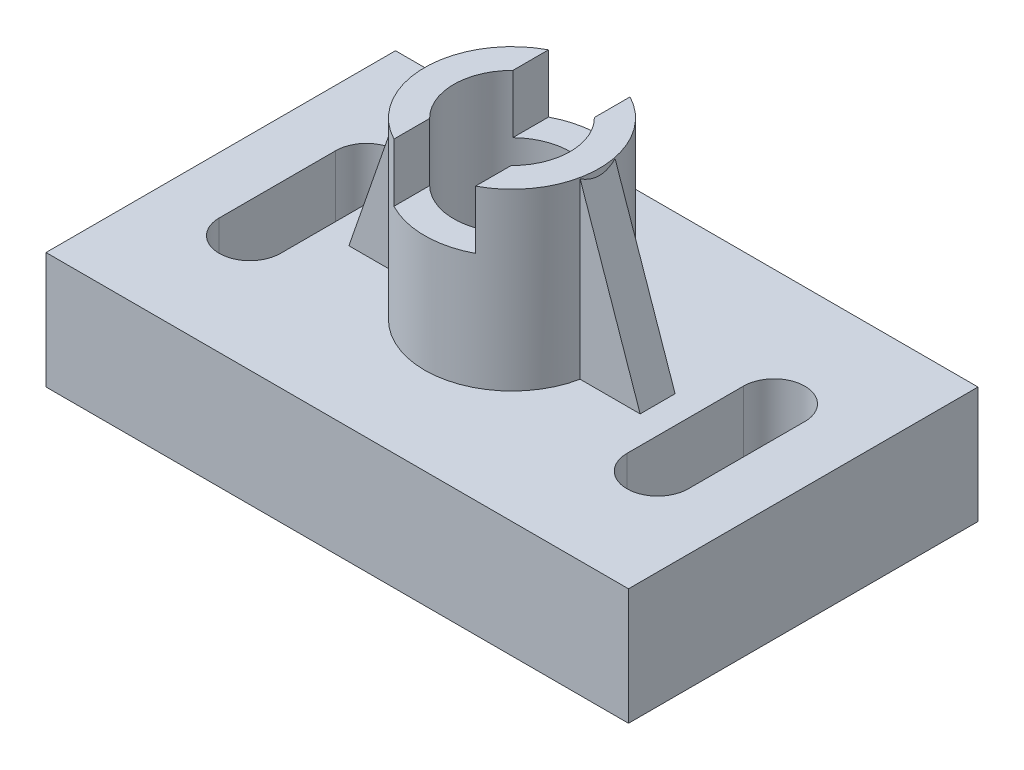
ISO-10303-21;
HEADER;
FILE_DESCRIPTION(('STEP AP214'),'2;1');
FILE_NAME('part.step','',(''),(''),'','','');
FILE_SCHEMA(('AUTOMOTIVE_DESIGN { 1 0 10303 214 1 1 1 1 }'));
ENDSEC;
DATA;
#1=APPLICATION_CONTEXT('core data for automotive mechanical design processes');
#2=APPLICATION_PROTOCOL_DEFINITION('international standard','automotive_design',2000,#1);
#3=PRODUCT_CONTEXT('',#1,'mechanical');
#4=PRODUCT('Part','Part','',(#3));
#5=PRODUCT_RELATED_PRODUCT_CATEGORY('part','',(#4));
#6=PRODUCT_DEFINITION_FORMATION('','',#4);
#7=PRODUCT_DEFINITION_CONTEXT('part definition',#1,'design');
#8=PRODUCT_DEFINITION('design','',#6,#7);
#9=PRODUCT_DEFINITION_SHAPE('','',#8);
#10=(LENGTH_UNIT() NAMED_UNIT(*) SI_UNIT(.MILLI.,.METRE.));
#11=(NAMED_UNIT(*) PLANE_ANGLE_UNIT() SI_UNIT($,.RADIAN.));
#12=(NAMED_UNIT(*) SI_UNIT($,.STERADIAN.) SOLID_ANGLE_UNIT());
#13=UNCERTAINTY_MEASURE_WITH_UNIT(LENGTH_MEASURE(1.E-05),#10,'distance_accuracy_value','');
#14=(GEOMETRIC_REPRESENTATION_CONTEXT(3) GLOBAL_UNCERTAINTY_ASSIGNED_CONTEXT((#13)) GLOBAL_UNIT_ASSIGNED_CONTEXT((#10,
#11,#12)) REPRESENTATION_CONTEXT('',''));
#15=CARTESIAN_POINT('',(0.,0.,0.));
#16=DIRECTION('',(0.,0.,1.));
#17=DIRECTION('',(1.,0.,0.));
#18=AXIS2_PLACEMENT_3D('',#15,#16,#17);
#19=CARTESIAN_POINT('',(0.,50.,0.));
#20=DIRECTION('',(0.,1.,0.));
#21=DIRECTION('',(0.,0.,1.));
#22=AXIS2_PLACEMENT_3D('',#19,#20,#21);
#23=PLANE('',#22);
#24=DIRECTION('',(0.,0.,-1.));
#25=VECTOR('',#24,1.);
#26=CARTESIAN_POINT('',(-7.,50.,0.));
#27=LINE('',#26,#25);
#28=CARTESIAN_POINT('',(-7.,50.,13.2664991614216));
#29=VERTEX_POINT('',#28);
#30=CARTESIAN_POINT('',(-7.,50.,7.14142842854285));
#31=VERTEX_POINT('',#30);
#32=EDGE_CURVE('E460',#29,#31,#27,.T.);
#33=ORIENTED_EDGE('',*,*,#32,.T.);
#34=CARTESIAN_POINT('',(0.,50.,0.));
#35=DIRECTION('',(0.,1.,0.));
#36=DIRECTION('',(0.,0.,1.));
#37=AXIS2_PLACEMENT_3D('',#34,#35,#36);
#38=CIRCLE('',#37,10.);
#39=CARTESIAN_POINT('',(-7.,50.,-7.14142842854285));
#40=VERTEX_POINT('',#39);
#41=EDGE_CURVE('E222',#40,#31,#38,.T.);
#42=ORIENTED_EDGE('',*,*,#41,.F.);
#43=CARTESIAN_POINT('',(-7.,50.,-13.2664991614216));
#44=VERTEX_POINT('',#43);
#45=EDGE_CURVE('E456',#40,#44,#27,.T.);
#46=ORIENTED_EDGE('',*,*,#45,.T.);
#47=CARTESIAN_POINT('',(0.,50.,0.));
#48=DIRECTION('',(0.,1.,0.));
#49=DIRECTION('',(0.,0.,1.));
#50=AXIS2_PLACEMENT_3D('',#47,#48,#49);
#51=CIRCLE('',#50,15.);
#52=EDGE_CURVE('E323',#44,#29,#51,.T.);
#53=ORIENTED_EDGE('',*,*,#52,.T.);
#54=EDGE_LOOP('',(#33,#42,#46,#53));
#55=FACE_BOUND('',#54,.T.);
#56=ADVANCED_FACE('F41',(#55),#23,.T.);
#57=CARTESIAN_POINT('',(-35.,20.,9.99999999999999));
#58=DIRECTION('',(0.,-1.,0.));
#59=DIRECTION('',(0.,0.,-1.));
#60=AXIS2_PLACEMENT_3D('',#57,#58,#59);
#61=CYLINDRICAL_SURFACE('',#60,5.26829268292683);
#62=CARTESIAN_POINT('',(-35.,0.,9.99999999999999));
#63=DIRECTION('',(0.,1.,0.));
#64=DIRECTION('',(0.,0.,1.));
#65=AXIS2_PLACEMENT_3D('',#62,#63,#64);
#66=CIRCLE('',#65,5.26829268292683);
#67=CARTESIAN_POINT('',(-40.2682926829268,0.,10.));
#68=VERTEX_POINT('',#67);
#69=CARTESIAN_POINT('',(-29.7317073170732,0.,9.99999999999999));
#70=VERTEX_POINT('',#69);
#71=EDGE_CURVE('E397',#68,#70,#66,.T.);
#72=ORIENTED_EDGE('',*,*,#71,.F.);
#73=DIRECTION('',(0.,-1.,0.));
#74=VECTOR('',#73,1.);
#75=CARTESIAN_POINT('',(-40.2682926829268,20.,10.));
#76=LINE('',#75,#74);
#77=CARTESIAN_POINT('',(-40.2682926829268,20.,10.));
#78=VERTEX_POINT('',#77);
#79=EDGE_CURVE('E421',#78,#68,#76,.T.);
#80=ORIENTED_EDGE('',*,*,#79,.F.);
#81=CARTESIAN_POINT('',(-35.,20.,9.99999999999999));
#82=DIRECTION('',(0.,1.,0.));
#83=DIRECTION('',(0.,0.,1.));
#84=AXIS2_PLACEMENT_3D('',#81,#82,#83);
#85=CIRCLE('',#84,5.26829268292683);
#86=CARTESIAN_POINT('',(-29.7317073170732,20.,9.99999999999999));
#87=VERTEX_POINT('',#86);
#88=EDGE_CURVE('E356',#78,#87,#85,.T.);
#89=ORIENTED_EDGE('',*,*,#88,.T.);
#90=DIRECTION('',(0.,-1.,0.));
#91=VECTOR('',#90,1.);
#92=CARTESIAN_POINT('',(-29.7317073170732,20.,9.99999999999999));
#93=LINE('',#92,#91);
#94=EDGE_CURVE('E410',#87,#70,#93,.T.);
#95=ORIENTED_EDGE('',*,*,#94,.T.);
#96=EDGE_LOOP('',(#72,#80,#89,#95));
#97=FACE_BOUND('',#96,.T.);
#98=ADVANCED_FACE('F536',(#97),#61,.F.);
#99=CARTESIAN_POINT('',(-40.2682926829268,20.,0.));
#100=DIRECTION('',(1.,0.,0.));
#101=DIRECTION('',(0.,0.,-1.));
#102=AXIS2_PLACEMENT_3D('',#99,#100,#101);
#103=PLANE('',#102);
#104=ORIENTED_EDGE('',*,*,#79,.T.);
#105=DIRECTION('',(0.,0.,1.));
#106=VECTOR('',#105,1.);
#107=CARTESIAN_POINT('',(-40.2682926829268,0.,0.));
#108=LINE('',#107,#106);
#109=CARTESIAN_POINT('',(-40.2682926829268,0.,-10.));
#110=VERTEX_POINT('',#109);
#111=EDGE_CURVE('E401',#110,#68,#108,.T.);
#112=ORIENTED_EDGE('',*,*,#111,.F.);
#113=DIRECTION('',(0.,-1.,0.));
#114=VECTOR('',#113,1.);
#115=CARTESIAN_POINT('',(-40.2682926829268,20.,-10.));
#116=LINE('',#115,#114);
#117=CARTESIAN_POINT('',(-40.2682926829268,20.,-10.));
#118=VERTEX_POINT('',#117);
#119=EDGE_CURVE('E418',#118,#110,#116,.T.);
#120=ORIENTED_EDGE('',*,*,#119,.F.);
#121=DIRECTION('',(0.,0.,1.));
#122=VECTOR('',#121,1.);
#123=CARTESIAN_POINT('',(-40.2682926829268,20.,0.));
#124=LINE('',#123,#122);
#125=EDGE_CURVE('E360',#118,#78,#124,.T.);
#126=ORIENTED_EDGE('',*,*,#125,.T.);
#127=EDGE_LOOP('',(#104,#112,#120,#126));
#128=FACE_BOUND('',#127,.T.);
#129=ADVANCED_FACE('F541',(#128),#103,.T.);
#130=CARTESIAN_POINT('',(-35.,20.,-10.));
#131=DIRECTION('',(0.,-1.,0.));
#132=DIRECTION('',(0.,0.,-1.));
#133=AXIS2_PLACEMENT_3D('',#130,#131,#132);
#134=CYLINDRICAL_SURFACE('',#133,5.26829268292683);
#135=CARTESIAN_POINT('',(-35.,0.,-10.));
#136=DIRECTION('',(0.,1.,0.));
#137=DIRECTION('',(0.,0.,1.));
#138=AXIS2_PLACEMENT_3D('',#135,#136,#137);
#139=CIRCLE('',#138,5.26829268292683);
#140=CARTESIAN_POINT('',(-29.7317073170732,0.,-10.));
#141=VERTEX_POINT('',#140);
#142=EDGE_CURVE('E404',#141,#110,#139,.T.);
#143=ORIENTED_EDGE('',*,*,#142,.F.);
#144=DIRECTION('',(0.,-1.,0.));
#145=VECTOR('',#144,1.);
#146=CARTESIAN_POINT('',(-29.7317073170732,20.,-10.));
#147=LINE('',#146,#145);
#148=CARTESIAN_POINT('',(-29.7317073170732,20.,-10.));
#149=VERTEX_POINT('',#148);
#150=EDGE_CURVE('E414',#149,#141,#147,.T.);
#151=ORIENTED_EDGE('',*,*,#150,.F.);
#152=CARTESIAN_POINT('',(-35.,20.,-10.));
#153=DIRECTION('',(0.,1.,0.));
#154=DIRECTION('',(0.,0.,1.));
#155=AXIS2_PLACEMENT_3D('',#152,#153,#154);
#156=CIRCLE('',#155,5.26829268292683);
#157=EDGE_CURVE('E363',#149,#118,#156,.T.);
#158=ORIENTED_EDGE('',*,*,#157,.T.);
#159=ORIENTED_EDGE('',*,*,#119,.T.);
#160=EDGE_LOOP('',(#143,#151,#158,#159));
#161=FACE_BOUND('',#160,.T.);
#162=ADVANCED_FACE('F571',(#161),#134,.F.);
#163=CARTESIAN_POINT('',(40.2682926829268,20.,0.));
#164=DIRECTION('',(1.,0.,0.));
#165=DIRECTION('',(0.,0.,-1.));
#166=AXIS2_PLACEMENT_3D('',#163,#164,#165);
#167=PLANE('',#166);
#168=DIRECTION('',(0.,-1.,0.));
#169=VECTOR('',#168,1.);
#170=CARTESIAN_POINT('',(40.2682926829268,20.,9.99999999999998));
#171=LINE('',#170,#169);
#172=CARTESIAN_POINT('',(40.2682926829268,20.,9.99999999999998));
#173=VERTEX_POINT('',#172);
#174=CARTESIAN_POINT('',(40.2682926829268,0.,9.99999999999998));
#175=VERTEX_POINT('',#174);
#176=EDGE_CURVE('E415',#173,#175,#171,.T.);
#177=ORIENTED_EDGE('',*,*,#176,.F.);
#178=DIRECTION('',(0.,0.,1.));
#179=VECTOR('',#178,1.);
#180=CARTESIAN_POINT('',(40.2682926829268,20.,0.));
#181=LINE('',#180,#179);
#182=CARTESIAN_POINT('',(40.2682926829268,20.,-10.));
#183=VERTEX_POINT('',#182);
#184=EDGE_CURVE('E343',#183,#173,#181,.T.);
#185=ORIENTED_EDGE('',*,*,#184,.F.);
#186=DIRECTION('',(0.,-1.,0.));
#187=VECTOR('',#186,1.);
#188=CARTESIAN_POINT('',(40.2682926829268,20.,-10.));
#189=LINE('',#188,#187);
#190=CARTESIAN_POINT('',(40.2682926829268,0.,-10.));
#191=VERTEX_POINT('',#190);
#192=EDGE_CURVE('E426',#183,#191,#189,.T.);
#193=ORIENTED_EDGE('',*,*,#192,.T.);
#194=DIRECTION('',(0.,0.,1.));
#195=VECTOR('',#194,1.);
#196=CARTESIAN_POINT('',(40.2682926829268,0.,0.));
#197=LINE('',#196,#195);
#198=EDGE_CURVE('E384',#191,#175,#197,.T.);
#199=ORIENTED_EDGE('',*,*,#198,.T.);
#200=EDGE_LOOP('',(#177,#185,#193,#199));
#201=FACE_BOUND('',#200,.T.);
#202=ADVANCED_FACE('F574',(#201),#167,.F.);
#203=CARTESIAN_POINT('',(35.,20.,9.99999999999998));
#204=DIRECTION('',(0.,-1.,0.));
#205=DIRECTION('',(0.,0.,-1.));
#206=AXIS2_PLACEMENT_3D('',#203,#204,#205);
#207=CYLINDRICAL_SURFACE('',#206,5.26829268292683);
#208=CARTESIAN_POINT('',(35.,0.,9.99999999999998));
#209=DIRECTION('',(0.,1.,0.));
#210=DIRECTION('',(0.,0.,1.));
#211=AXIS2_PLACEMENT_3D('',#208,#209,#210);
#212=CIRCLE('',#211,5.26829268292683);
#213=CARTESIAN_POINT('',(29.7317073170732,0.,9.99999999999998));
#214=VERTEX_POINT('',#213);
#215=EDGE_CURVE('E387',#175,#214,#212,.F.);
#216=ORIENTED_EDGE('',*,*,#215,.T.);
#217=DIRECTION('',(0.,-1.,0.));
#218=VECTOR('',#217,1.);
#219=CARTESIAN_POINT('',(29.7317073170732,20.,9.99999999999998));
#220=LINE('',#219,#218);
#221=CARTESIAN_POINT('',(29.7317073170732,20.,9.99999999999998));
#222=VERTEX_POINT('',#221);
#223=EDGE_CURVE('E434',#222,#214,#220,.T.);
#224=ORIENTED_EDGE('',*,*,#223,.F.);
#225=CARTESIAN_POINT('',(35.,20.,9.99999999999998));
#226=DIRECTION('',(0.,1.,0.));
#227=DIRECTION('',(0.,0.,1.));
#228=AXIS2_PLACEMENT_3D('',#225,#226,#227);
#229=CIRCLE('',#228,5.26829268292683);
#230=EDGE_CURVE('E346',#173,#222,#229,.F.);
#231=ORIENTED_EDGE('',*,*,#230,.F.);
#232=ORIENTED_EDGE('',*,*,#176,.T.);
#233=EDGE_LOOP('',(#216,#224,#231,#232));
#234=FACE_BOUND('',#233,.T.);
#235=ADVANCED_FACE('F587',(#234),#207,.F.);
#236=CARTESIAN_POINT('',(29.7317073170732,20.,0.));
#237=DIRECTION('',(1.,0.,0.));
#238=DIRECTION('',(0.,0.,-1.));
#239=AXIS2_PLACEMENT_3D('',#236,#237,#238);
#240=PLANE('',#239);
#241=ORIENTED_EDGE('',*,*,#223,.T.);
#242=DIRECTION('',(0.,0.,1.));
#243=VECTOR('',#242,1.);
#244=CARTESIAN_POINT('',(29.7317073170732,0.,0.));
#245=LINE('',#244,#243);
#246=CARTESIAN_POINT('',(29.7317073170732,0.,-10.));
#247=VERTEX_POINT('',#246);
#248=EDGE_CURVE('E391',#247,#214,#245,.T.);
#249=ORIENTED_EDGE('',*,*,#248,.F.);
#250=DIRECTION('',(0.,-1.,0.));
#251=VECTOR('',#250,1.);
#252=CARTESIAN_POINT('',(29.7317073170732,20.,-10.));
#253=LINE('',#252,#251);
#254=CARTESIAN_POINT('',(29.7317073170732,20.,-10.));
#255=VERTEX_POINT('',#254);
#256=EDGE_CURVE('E430',#255,#247,#253,.T.);
#257=ORIENTED_EDGE('',*,*,#256,.F.);
#258=DIRECTION('',(0.,0.,1.));
#259=VECTOR('',#258,1.);
#260=CARTESIAN_POINT('',(29.7317073170732,20.,0.));
#261=LINE('',#260,#259);
#262=EDGE_CURVE('E350',#255,#222,#261,.T.);
#263=ORIENTED_EDGE('',*,*,#262,.T.);
#264=EDGE_LOOP('',(#241,#249,#257,#263));
#265=FACE_BOUND('',#264,.T.);
#266=ADVANCED_FACE('F584',(#265),#240,.T.);
#267=CARTESIAN_POINT('',(50.,20.,0.));
#268=DIRECTION('',(1.,0.,0.));
#269=DIRECTION('',(0.,0.,-1.));
#270=AXIS2_PLACEMENT_3D('',#267,#268,#269);
#271=PLANE('',#270);
#272=DIRECTION('',(0.,-1.,0.));
#273=VECTOR('',#272,1.);
#274=CARTESIAN_POINT('',(50.,20.,30.));
#275=LINE('',#274,#273);
#276=CARTESIAN_POINT('',(50.,20.,30.));
#277=VERTEX_POINT('',#276);
#278=CARTESIAN_POINT('',(50.,0.,30.));
#279=VERTEX_POINT('',#278);
#280=EDGE_CURVE('E370',#277,#279,#275,.T.);
#281=ORIENTED_EDGE('',*,*,#280,.T.);
#282=DIRECTION('',(0.,0.,1.));
#283=VECTOR('',#282,1.);
#284=CARTESIAN_POINT('',(50.,0.,0.));
#285=LINE('',#284,#283);
#286=CARTESIAN_POINT('',(50.,0.,-30.));
#287=VERTEX_POINT('',#286);
#288=EDGE_CURVE('E326',#287,#279,#285,.T.);
#289=ORIENTED_EDGE('',*,*,#288,.F.);
#290=DIRECTION('',(0.,-1.,0.));
#291=VECTOR('',#290,1.);
#292=CARTESIAN_POINT('',(50.,20.,-30.));
#293=LINE('',#292,#291);
#294=CARTESIAN_POINT('',(50.,20.,-30.));
#295=VERTEX_POINT('',#294);
#296=EDGE_CURVE('E431',#295,#287,#293,.T.);
#297=ORIENTED_EDGE('',*,*,#296,.F.);
#298=DIRECTION('',(0.,0.,1.));
#299=VECTOR('',#298,1.);
#300=CARTESIAN_POINT('',(50.,20.,0.));
#301=LINE('',#300,#299);
#302=EDGE_CURVE('E328',#295,#277,#301,.T.);
#303=ORIENTED_EDGE('',*,*,#302,.T.);
#304=EDGE_LOOP('',(#281,#289,#297,#303));
#305=FACE_BOUND('',#304,.T.);
#306=ADVANCED_FACE('F43',(#305),#271,.T.);
#307=CARTESIAN_POINT('',(0.,20.,-30.));
#308=DIRECTION('',(0.,0.,-1.));
#309=DIRECTION('',(-1.,0.,0.));
#310=AXIS2_PLACEMENT_3D('',#307,#308,#309);
#311=PLANE('',#310);
#312=DIRECTION('',(1.,0.,0.));
#313=VECTOR('',#312,1.);
#314=CARTESIAN_POINT('',(0.,0.,-30.));
#315=LINE('',#314,#313);
#316=CARTESIAN_POINT('',(-50.,0.,-30.));
#317=VERTEX_POINT('',#316);
#318=EDGE_CURVE('E373',#317,#287,#315,.T.);
#319=ORIENTED_EDGE('',*,*,#318,.F.);
#320=DIRECTION('',(0.,-1.,0.));
#321=VECTOR('',#320,1.);
#322=CARTESIAN_POINT('',(-50.,20.,-30.));
#323=LINE('',#322,#321);
#324=CARTESIAN_POINT('',(-50.,20.,-30.));
#325=VERTEX_POINT('',#324);
#326=EDGE_CURVE('E448',#325,#317,#323,.T.);
#327=ORIENTED_EDGE('',*,*,#326,.F.);
#328=DIRECTION('',(1.,0.,0.));
#329=VECTOR('',#328,1.);
#330=CARTESIAN_POINT('',(0.,20.,-30.));
#331=LINE('',#330,#329);
#332=EDGE_CURVE('E331',#325,#295,#331,.T.);
#333=ORIENTED_EDGE('',*,*,#332,.T.);
#334=ORIENTED_EDGE('',*,*,#296,.T.);
#335=EDGE_LOOP('',(#319,#327,#333,#334));
#336=FACE_BOUND('',#335,.T.);
#337=ADVANCED_FACE('F599',(#336),#311,.T.);
#338=CARTESIAN_POINT('',(-50.,20.,0.));
#339=DIRECTION('',(1.,0.,0.));
#340=DIRECTION('',(0.,0.,-1.));
#341=AXIS2_PLACEMENT_3D('',#338,#339,#340);
#342=PLANE('',#341);
#343=DIRECTION('',(0.,-1.,0.));
#344=VECTOR('',#343,1.);
#345=CARTESIAN_POINT('',(-50.,20.,30.));
#346=LINE('',#345,#344);
#347=CARTESIAN_POINT('',(-50.,20.,30.));
#348=VERTEX_POINT('',#347);
#349=CARTESIAN_POINT('',(-50.,0.,30.));
#350=VERTEX_POINT('',#349);
#351=EDGE_CURVE('E444',#348,#350,#346,.T.);
#352=ORIENTED_EDGE('',*,*,#351,.F.);
#353=DIRECTION('',(0.,0.,1.));
#354=VECTOR('',#353,1.);
#355=CARTESIAN_POINT('',(-50.,20.,0.));
#356=LINE('',#355,#354);
#357=EDGE_CURVE('E336',#325,#348,#356,.T.);
#358=ORIENTED_EDGE('',*,*,#357,.F.);
#359=ORIENTED_EDGE('',*,*,#326,.T.);
#360=DIRECTION('',(0.,0.,1.));
#361=VECTOR('',#360,1.);
#362=CARTESIAN_POINT('',(-50.,0.,0.));
#363=LINE('',#362,#361);
#364=EDGE_CURVE('E377',#317,#350,#363,.T.);
#365=ORIENTED_EDGE('',*,*,#364,.T.);
#366=EDGE_LOOP('',(#352,#358,#359,#365));
#367=FACE_BOUND('',#366,.T.);
#368=ADVANCED_FACE('F582',(#367),#342,.F.);
#369=CARTESIAN_POINT('',(35.,20.,-10.));
#370=DIRECTION('',(0.,-1.,0.));
#371=DIRECTION('',(0.,0.,-1.));
#372=AXIS2_PLACEMENT_3D('',#369,#370,#371);
#373=CYLINDRICAL_SURFACE('',#372,5.26829268292684);
#374=CARTESIAN_POINT('',(35.,0.,-10.));
#375=DIRECTION('',(0.,1.,0.));
#376=DIRECTION('',(0.,0.,1.));
#377=AXIS2_PLACEMENT_3D('',#374,#375,#376);
#378=CIRCLE('',#377,5.26829268292684);
#379=EDGE_CURVE('E394',#247,#191,#378,.F.);
#380=ORIENTED_EDGE('',*,*,#379,.T.);
#381=ORIENTED_EDGE('',*,*,#192,.F.);
#382=CARTESIAN_POINT('',(35.,20.,-10.));
#383=DIRECTION('',(0.,1.,0.));
#384=DIRECTION('',(0.,0.,1.));
#385=AXIS2_PLACEMENT_3D('',#382,#383,#384);
#386=CIRCLE('',#385,5.26829268292684);
#387=EDGE_CURVE('E353',#255,#183,#386,.F.);
#388=ORIENTED_EDGE('',*,*,#387,.F.);
#389=ORIENTED_EDGE('',*,*,#256,.T.);
#390=EDGE_LOOP('',(#380,#381,#388,#389));
#391=FACE_BOUND('',#390,.T.);
#392=ADVANCED_FACE('F579',(#391),#373,.F.);
#393=CARTESIAN_POINT('',(0.,20.,30.));
#394=DIRECTION('',(0.,0.,-1.));
#395=DIRECTION('',(-1.,0.,0.));
#396=AXIS2_PLACEMENT_3D('',#393,#394,#395);
#397=PLANE('',#396);
#398=DIRECTION('',(1.,0.,0.));
#399=VECTOR('',#398,1.);
#400=CARTESIAN_POINT('',(0.,0.,30.));
#401=LINE('',#400,#399);
#402=EDGE_CURVE('E380',#350,#279,#401,.T.);
#403=ORIENTED_EDGE('',*,*,#402,.T.);
#404=ORIENTED_EDGE('',*,*,#280,.F.);
#405=DIRECTION('',(1.,0.,0.));
#406=VECTOR('',#405,1.);
#407=CARTESIAN_POINT('',(0.,20.,30.));
#408=LINE('',#407,#406);
#409=EDGE_CURVE('E339',#348,#277,#408,.T.);
#410=ORIENTED_EDGE('',*,*,#409,.F.);
#411=ORIENTED_EDGE('',*,*,#351,.T.);
#412=EDGE_LOOP('',(#403,#404,#410,#411));
#413=FACE_BOUND('',#412,.T.);
#414=ADVANCED_FACE('F569',(#413),#397,.F.);
#415=CARTESIAN_POINT('',(-29.7317073170732,20.,0.));
#416=DIRECTION('',(1.,0.,0.));
#417=DIRECTION('',(0.,0.,-1.));
#418=AXIS2_PLACEMENT_3D('',#415,#416,#417);
#419=PLANE('',#418);
#420=DIRECTION('',(0.,0.,1.));
#421=VECTOR('',#420,1.);
#422=CARTESIAN_POINT('',(-29.7317073170732,0.,0.));
#423=LINE('',#422,#421);
#424=EDGE_CURVE('E332',#141,#70,#423,.T.);
#425=ORIENTED_EDGE('',*,*,#424,.T.);
#426=ORIENTED_EDGE('',*,*,#94,.F.);
#427=DIRECTION('',(0.,0.,1.));
#428=VECTOR('',#427,1.);
#429=CARTESIAN_POINT('',(-29.7317073170732,20.,0.));
#430=LINE('',#429,#428);
#431=EDGE_CURVE('E367',#149,#87,#430,.T.);
#432=ORIENTED_EDGE('',*,*,#431,.F.);
#433=ORIENTED_EDGE('',*,*,#150,.T.);
#434=EDGE_LOOP('',(#425,#426,#432,#433));
#435=FACE_BOUND('',#434,.T.);
#436=ADVANCED_FACE('F562',(#435),#419,.F.);
#437=CARTESIAN_POINT('',(0.,20.,0.));
#438=DIRECTION('',(0.,1.,0.));
#439=DIRECTION('',(0.,0.,1.));
#440=AXIS2_PLACEMENT_3D('',#437,#438,#439);
#441=PLANE('',#440);
#442=ORIENTED_EDGE('',*,*,#230,.T.);
#443=ORIENTED_EDGE('',*,*,#262,.F.);
#444=ORIENTED_EDGE('',*,*,#387,.T.);
#445=ORIENTED_EDGE('',*,*,#184,.T.);
#446=EDGE_LOOP('',(#442,#443,#444,#445));
#447=FACE_BOUND('',#446,.T.);
#448=ORIENTED_EDGE('',*,*,#409,.T.);
#449=ORIENTED_EDGE('',*,*,#302,.F.);
#450=ORIENTED_EDGE('',*,*,#332,.F.);
#451=ORIENTED_EDGE('',*,*,#357,.T.);
#452=EDGE_LOOP('',(#448,#449,#450,#451));
#453=FACE_BOUND('',#452,.T.);
#454=DIRECTION('',(0.,0.,1.));
#455=VECTOR('',#454,1.);
#456=CARTESIAN_POINT('',(25.,20.,0.));
#457=LINE('',#456,#455);
#458=CARTESIAN_POINT('',(25.,20.,3.));
#459=VERTEX_POINT('',#458);
#460=CARTESIAN_POINT('',(25.,20.,-3.));
#461=VERTEX_POINT('',#460);
#462=EDGE_CURVE('E273',#459,#461,#457,.F.);
#463=ORIENTED_EDGE('',*,*,#462,.F.);
#464=DIRECTION('',(1.,0.,0.));
#465=VECTOR('',#464,1.);
#466=CARTESIAN_POINT('',(0.,20.,3.));
#467=LINE('',#466,#465);
#468=CARTESIAN_POINT('',(14.6969384566991,20.,3.));
#469=VERTEX_POINT('',#468);
#470=EDGE_CURVE('E264',#469,#459,#467,.T.);
#471=ORIENTED_EDGE('',*,*,#470,.F.);
#472=CARTESIAN_POINT('',(0.,20.,0.));
#473=DIRECTION('',(0.,1.,0.));
#474=DIRECTION('',(0.,0.,1.));
#475=AXIS2_PLACEMENT_3D('',#472,#473,#474);
#476=CIRCLE('',#475,15.);
#477=CARTESIAN_POINT('',(-14.6969384566991,20.,3.));
#478=VERTEX_POINT('',#477);
#479=EDGE_CURVE('E223',#478,#469,#476,.T.);
#480=ORIENTED_EDGE('',*,*,#479,.F.);
#481=DIRECTION('',(1.,0.,0.));
#482=VECTOR('',#481,1.);
#483=CARTESIAN_POINT('',(0.,20.,3.));
#484=LINE('',#483,#482);
#485=CARTESIAN_POINT('',(-25.,20.,3.));
#486=VERTEX_POINT('',#485);
#487=EDGE_CURVE('E57',#486,#478,#484,.T.);
#488=ORIENTED_EDGE('',*,*,#487,.F.);
#489=DIRECTION('',(0.,0.,1.));
#490=VECTOR('',#489,1.);
#491=CARTESIAN_POINT('',(-25.,20.,0.));
#492=LINE('',#491,#490);
#493=CARTESIAN_POINT('',(-25.,20.,-3.));
#494=VERTEX_POINT('',#493);
#495=EDGE_CURVE('E61',#494,#486,#492,.T.);
#496=ORIENTED_EDGE('',*,*,#495,.F.);
#497=DIRECTION('',(1.,0.,0.));
#498=VECTOR('',#497,1.);
#499=CARTESIAN_POINT('',(0.,20.,-3.));
#500=LINE('',#499,#498);
#501=CARTESIAN_POINT('',(-14.6969384566991,20.,-3.));
#502=VERTEX_POINT('',#501);
#503=EDGE_CURVE('E225',#494,#502,#500,.T.);
#504=ORIENTED_EDGE('',*,*,#503,.T.);
#505=CARTESIAN_POINT('',(14.6969384566991,20.,-3.));
#506=VERTEX_POINT('',#505);
#507=EDGE_CURVE('E213',#506,#502,#476,.T.);
#508=ORIENTED_EDGE('',*,*,#507,.F.);
#509=DIRECTION('',(1.,0.,0.));
#510=VECTOR('',#509,1.);
#511=CARTESIAN_POINT('',(0.,20.,-3.));
#512=LINE('',#511,#510);
#513=EDGE_CURVE('E258',#506,#461,#512,.T.);
#514=ORIENTED_EDGE('',*,*,#513,.T.);
#515=EDGE_LOOP('',(#463,#471,#480,#488,#496,#504,#508,#514));
#516=FACE_BOUND('',#515,.T.);
#517=ORIENTED_EDGE('',*,*,#88,.F.);
#518=ORIENTED_EDGE('',*,*,#125,.F.);
#519=ORIENTED_EDGE('',*,*,#157,.F.);
#520=ORIENTED_EDGE('',*,*,#431,.T.);
#521=EDGE_LOOP('',(#517,#518,#519,#520));
#522=FACE_BOUND('',#521,.T.);
#523=ADVANCED_FACE('F226',(#447,#453,#516,#522),#441,.T.);
#524=CARTESIAN_POINT('',(0.,0.,0.));
#525=DIRECTION('',(0.,1.,0.));
#526=DIRECTION('',(0.,0.,1.));
#527=AXIS2_PLACEMENT_3D('',#524,#525,#526);
#528=PLANE('',#527);
#529=ORIENTED_EDGE('',*,*,#248,.T.);
#530=ORIENTED_EDGE('',*,*,#215,.F.);
#531=ORIENTED_EDGE('',*,*,#198,.F.);
#532=ORIENTED_EDGE('',*,*,#379,.F.);
#533=EDGE_LOOP('',(#529,#530,#531,#532));
#534=FACE_BOUND('',#533,.T.);
#535=ORIENTED_EDGE('',*,*,#288,.T.);
#536=ORIENTED_EDGE('',*,*,#402,.F.);
#537=ORIENTED_EDGE('',*,*,#364,.F.);
#538=ORIENTED_EDGE('',*,*,#318,.T.);
#539=EDGE_LOOP('',(#535,#536,#537,#538));
#540=FACE_BOUND('',#539,.T.);
#541=ORIENTED_EDGE('',*,*,#71,.T.);
#542=ORIENTED_EDGE('',*,*,#424,.F.);
#543=ORIENTED_EDGE('',*,*,#142,.T.);
#544=ORIENTED_EDGE('',*,*,#111,.T.);
#545=EDGE_LOOP('',(#541,#542,#543,#544));
#546=FACE_BOUND('',#545,.T.);
#547=ADVANCED_FACE('F557',(#534,#540,#546),#528,.F.);
#548=CARTESIAN_POINT('',(0.,50.,0.));
#549=DIRECTION('',(0.,-1.,0.));
#550=DIRECTION('',(0.,0.,-1.));
#551=AXIS2_PLACEMENT_3D('',#548,#549,#550);
#552=CYLINDRICAL_SURFACE('',#551,10.);
#553=CARTESIAN_POINT('',(0.,20.,0.));
#554=DIRECTION('',(0.,1.,0.));
#555=DIRECTION('',(0.,0.,1.));
#556=AXIS2_PLACEMENT_3D('',#553,#554,#555);
#557=CIRCLE('',#556,10.);
#558=CARTESIAN_POINT('',(0.,20.,10.));
#559=VERTEX_POINT('',#558);
#560=EDGE_CURVE('E425',#559,#559,#557,.F.);
#561=ORIENTED_EDGE('',*,*,#560,.T.);
#562=EDGE_LOOP('',(#561));
#563=FACE_BOUND('',#562,.T.);
#564=ORIENTED_EDGE('',*,*,#41,.T.);
#565=DIRECTION('',(0.,-1.,0.));
#566=VECTOR('',#565,1.);
#567=CARTESIAN_POINT('',(-7.,50.,7.14142842854285));
#568=LINE('',#567,#566);
#569=CARTESIAN_POINT('',(-7.,40.,7.14142842854285));
#570=VERTEX_POINT('',#569);
#571=EDGE_CURVE('E297',#31,#570,#568,.T.);
#572=ORIENTED_EDGE('',*,*,#571,.T.);
#573=CARTESIAN_POINT('',(0.,40.,0.));
#574=DIRECTION('',(0.,-1.,0.));
#575=DIRECTION('',(0.,0.,-1.));
#576=AXIS2_PLACEMENT_3D('',#573,#574,#575);
#577=CIRCLE('',#576,10.);
#578=CARTESIAN_POINT('',(7.,40.,7.14142842854285));
#579=VERTEX_POINT('',#578);
#580=EDGE_CURVE('E319',#579,#570,#577,.T.);
#581=ORIENTED_EDGE('',*,*,#580,.F.);
#582=DIRECTION('',(0.,-1.,0.));
#583=VECTOR('',#582,1.);
#584=CARTESIAN_POINT('',(7.,50.,7.14142842854285));
#585=LINE('',#584,#583);
#586=CARTESIAN_POINT('',(7.,50.,7.14142842854285));
#587=VERTEX_POINT('',#586);
#588=EDGE_CURVE('E313',#587,#579,#585,.T.);
#589=ORIENTED_EDGE('',*,*,#588,.F.);
#590=CARTESIAN_POINT('',(7.,50.,-7.14142842854285));
#591=VERTEX_POINT('',#590);
#592=EDGE_CURVE('E320',#587,#591,#38,.T.);
#593=ORIENTED_EDGE('',*,*,#592,.T.);
#594=DIRECTION('',(0.,-1.,0.));
#595=VECTOR('',#594,1.);
#596=CARTESIAN_POINT('',(7.,50.,-7.14142842854285));
#597=LINE('',#596,#595);
#598=CARTESIAN_POINT('',(7.,40.,-7.14142842854285));
#599=VERTEX_POINT('',#598);
#600=EDGE_CURVE('E309',#599,#591,#597,.F.);
#601=ORIENTED_EDGE('',*,*,#600,.F.);
#602=CARTESIAN_POINT('',(-7.,40.,-7.14142842854285));
#603=VERTEX_POINT('',#602);
#604=EDGE_CURVE('E316',#603,#599,#577,.T.);
#605=ORIENTED_EDGE('',*,*,#604,.F.);
#606=DIRECTION('',(0.,-1.,0.));
#607=VECTOR('',#606,1.);
#608=CARTESIAN_POINT('',(-7.,50.,-7.14142842854285));
#609=LINE('',#608,#607);
#610=EDGE_CURVE('E293',#603,#40,#609,.F.);
#611=ORIENTED_EDGE('',*,*,#610,.T.);
#612=EDGE_LOOP('',(#564,#572,#581,#589,#593,#601,#605,#611));
#613=FACE_BOUND('',#612,.T.);
#614=ADVANCED_FACE('F484',(#563,#613),#552,.F.);
#615=CARTESIAN_POINT('',(0.,50.,0.));
#616=DIRECTION('',(0.,-1.,0.));
#617=DIRECTION('',(0.,0.,-1.));
#618=AXIS2_PLACEMENT_3D('',#615,#616,#617);
#619=CYLINDRICAL_SURFACE('',#618,15.);
#620=DIRECTION('',(0.,-1.,0.));
#621=VECTOR('',#620,1.);
#622=CARTESIAN_POINT('',(7.,50.,-13.2664991614216));
#623=LINE('',#622,#621);
#624=CARTESIAN_POINT('',(7.,40.,-13.2664991614216));
#625=VERTEX_POINT('',#624);
#626=CARTESIAN_POINT('',(7.,50.,-13.2664991614216));
#627=VERTEX_POINT('',#626);
#628=EDGE_CURVE('E301',#625,#627,#623,.F.);
#629=ORIENTED_EDGE('',*,*,#628,.T.);
#630=CARTESIAN_POINT('',(7.,50.,13.2664991614216));
#631=VERTEX_POINT('',#630);
#632=EDGE_CURVE('E324',#631,#627,#51,.T.);
#633=ORIENTED_EDGE('',*,*,#632,.F.);
#634=DIRECTION('',(0.,-1.,0.));
#635=VECTOR('',#634,1.);
#636=CARTESIAN_POINT('',(7.,50.,13.2664991614216));
#637=LINE('',#636,#635);
#638=CARTESIAN_POINT('',(7.,40.,13.2664991614216));
#639=VERTEX_POINT('',#638);
#640=EDGE_CURVE('E305',#631,#639,#637,.T.);
#641=ORIENTED_EDGE('',*,*,#640,.T.);
#642=CARTESIAN_POINT('',(0.,40.,0.));
#643=DIRECTION('',(0.,-1.,0.));
#644=DIRECTION('',(0.,0.,-1.));
#645=AXIS2_PLACEMENT_3D('',#642,#643,#644);
#646=CIRCLE('',#645,15.);
#647=CARTESIAN_POINT('',(-7.,40.,13.2664991614216));
#648=VERTEX_POINT('',#647);
#649=EDGE_CURVE('E50',#639,#648,#646,.T.);
#650=ORIENTED_EDGE('',*,*,#649,.T.);
#651=DIRECTION('',(0.,-1.,0.));
#652=VECTOR('',#651,1.);
#653=CARTESIAN_POINT('',(-7.,50.,13.2664991614216));
#654=LINE('',#653,#652);
#655=EDGE_CURVE('E290',#29,#648,#654,.T.);
#656=ORIENTED_EDGE('',*,*,#655,.F.);
#657=ORIENTED_EDGE('',*,*,#52,.F.);
#658=DIRECTION('',(0.,-1.,0.));
#659=VECTOR('',#658,1.);
#660=CARTESIAN_POINT('',(-7.,50.,-13.2664991614216));
#661=LINE('',#660,#659);
#662=CARTESIAN_POINT('',(-7.,40.,-13.2664991614216));
#663=VERTEX_POINT('',#662);
#664=EDGE_CURVE('E287',#663,#44,#661,.F.);
#665=ORIENTED_EDGE('',*,*,#664,.F.);
#666=EDGE_CURVE('E465',#663,#625,#646,.T.);
#667=ORIENTED_EDGE('',*,*,#666,.T.);
#668=EDGE_LOOP('',(#629,#633,#641,#650,#656,#657,#665,#667));
#669=FACE_BOUND('',#668,.T.);
#670=DIRECTION('',(0.,-1.,0.));
#671=VECTOR('',#670,1.);
#672=CARTESIAN_POINT('',(14.6969384566991,50.,3.));
#673=LINE('',#672,#671);
#674=CARTESIAN_POINT('',(14.6969384566991,49.8043085308351,3.));
#675=VERTEX_POINT('',#674);
#676=EDGE_CURVE('E261',#469,#675,#673,.F.);
#677=ORIENTED_EDGE('',*,*,#676,.T.);
#678=CARTESIAN_POINT('',(0.,92.3190587709676,0.));
#679=DIRECTION('',(-0.945121406378158,-0.326719340115906,0.));
#680=DIRECTION('',(0.326719340115906,-0.945121406378158,0.));
#681=AXIS2_PLACEMENT_3D('',#678,#679,#680);
#682=ELLIPSE('',#681,45.9109644218755,15.);
#683=CARTESIAN_POINT('',(14.6969384566991,49.8043085308351,-3.));
#684=VERTEX_POINT('',#683);
#685=EDGE_CURVE('E268',#675,#684,#682,.F.);
#686=ORIENTED_EDGE('',*,*,#685,.T.);
#687=DIRECTION('',(0.,-1.,0.));
#688=VECTOR('',#687,1.);
#689=CARTESIAN_POINT('',(14.6969384566991,50.,-3.));
#690=LINE('',#689,#688);
#691=EDGE_CURVE('E219',#506,#684,#690,.F.);
#692=ORIENTED_EDGE('',*,*,#691,.F.);
#693=ORIENTED_EDGE('',*,*,#507,.T.);
#694=DIRECTION('',(0.,-1.,0.));
#695=VECTOR('',#694,1.);
#696=CARTESIAN_POINT('',(-14.6969384566991,50.,-3.));
#697=LINE('',#696,#695);
#698=CARTESIAN_POINT('',(-14.6969384566991,49.8043085308351,-3.));
#699=VERTEX_POINT('',#698);
#700=EDGE_CURVE('E216',#699,#502,#697,.T.);
#701=ORIENTED_EDGE('',*,*,#700,.F.);
#702=CARTESIAN_POINT('',(0.,92.3190587709676,0.));
#703=DIRECTION('',(-0.945121406378158,0.326719340115906,0.));
#704=DIRECTION('',(-0.326719340115906,-0.945121406378158,0.));
#705=AXIS2_PLACEMENT_3D('',#702,#703,#704);
#706=ELLIPSE('',#705,45.9109644218755,15.);
#707=CARTESIAN_POINT('',(-14.6969384566991,49.8043085308351,3.));
#708=VERTEX_POINT('',#707);
#709=EDGE_CURVE('E11',#699,#708,#706,.T.);
#710=ORIENTED_EDGE('',*,*,#709,.T.);
#711=DIRECTION('',(0.,-1.,0.));
#712=VECTOR('',#711,1.);
#713=CARTESIAN_POINT('',(-14.6969384566991,50.,3.));
#714=LINE('',#713,#712);
#715=EDGE_CURVE('E232',#708,#478,#714,.T.);
#716=ORIENTED_EDGE('',*,*,#715,.T.);
#717=ORIENTED_EDGE('',*,*,#479,.T.);
#718=EDGE_LOOP('',(#677,#686,#692,#693,#701,#710,#716,#717));
#719=FACE_BOUND('',#718,.T.);
#720=ADVANCED_FACE('F214',(#669,#719),#619,.T.);
#721=ORIENTED_EDGE('',*,*,#632,.T.);
#722=DIRECTION('',(0.,0.,-1.));
#723=VECTOR('',#722,1.);
#724=CARTESIAN_POINT('',(7.,50.,0.));
#725=LINE('',#724,#723);
#726=EDGE_CURVE('E461',#591,#627,#725,.T.);
#727=ORIENTED_EDGE('',*,*,#726,.F.);
#728=ORIENTED_EDGE('',*,*,#592,.F.);
#729=EDGE_CURVE('E464',#631,#587,#725,.T.);
#730=ORIENTED_EDGE('',*,*,#729,.F.);
#731=EDGE_LOOP('',(#721,#727,#728,#730));
#732=FACE_BOUND('',#731,.T.);
#733=ADVANCED_FACE('F487',(#732),#23,.T.);
#734=ORIENTED_EDGE('',*,*,#560,.F.);
#735=EDGE_LOOP('',(#734));
#736=FACE_BOUND('',#735,.T.);
#737=ADVANCED_FACE('F547',(#736),#441,.T.);
#738=CARTESIAN_POINT('',(7.,40.,17.6009976315934));
#739=DIRECTION('',(1.,0.,0.));
#740=DIRECTION('',(0.,0.,-1.));
#741=AXIS2_PLACEMENT_3D('',#738,#739,#740);
#742=PLANE('',#741);
#743=ORIENTED_EDGE('',*,*,#600,.T.);
#744=ORIENTED_EDGE('',*,*,#726,.T.);
#745=ORIENTED_EDGE('',*,*,#628,.F.);
#746=DIRECTION('',(0.,0.,-1.));
#747=VECTOR('',#746,1.);
#748=CARTESIAN_POINT('',(7.,40.,17.6009976315934));
#749=LINE('',#748,#747);
#750=EDGE_CURVE('E282',#599,#625,#749,.T.);
#751=ORIENTED_EDGE('',*,*,#750,.F.);
#752=EDGE_LOOP('',(#743,#744,#745,#751));
#753=FACE_BOUND('',#752,.T.);
#754=ADVANCED_FACE('F489',(#753),#742,.F.);
#755=CARTESIAN_POINT('',(-7.,40.,17.6009976315934));
#756=DIRECTION('',(1.,0.,0.));
#757=DIRECTION('',(0.,0.,-1.));
#758=AXIS2_PLACEMENT_3D('',#755,#756,#757);
#759=PLANE('',#758);
#760=DIRECTION('',(0.,0.,-1.));
#761=VECTOR('',#760,1.);
#762=CARTESIAN_POINT('',(-7.,40.,17.6009976315934));
#763=LINE('',#762,#761);
#764=EDGE_CURVE('E277',#603,#663,#763,.T.);
#765=ORIENTED_EDGE('',*,*,#764,.T.);
#766=ORIENTED_EDGE('',*,*,#664,.T.);
#767=ORIENTED_EDGE('',*,*,#45,.F.);
#768=ORIENTED_EDGE('',*,*,#610,.F.);
#769=EDGE_LOOP('',(#765,#766,#767,#768));
#770=FACE_BOUND('',#769,.T.);
#771=ADVANCED_FACE('F755',(#770),#759,.T.);
#772=CARTESIAN_POINT('',(0.,40.,0.));
#773=DIRECTION('',(0.,-1.,0.));
#774=DIRECTION('',(0.,0.,-1.));
#775=AXIS2_PLACEMENT_3D('',#772,#773,#774);
#776=PLANE('',#775);
#777=ORIENTED_EDGE('',*,*,#604,.T.);
#778=ORIENTED_EDGE('',*,*,#750,.T.);
#779=ORIENTED_EDGE('',*,*,#666,.F.);
#780=ORIENTED_EDGE('',*,*,#764,.F.);
#781=EDGE_LOOP('',(#777,#778,#779,#780));
#782=FACE_BOUND('',#781,.T.);
#783=ADVANCED_FACE('F763',(#782),#776,.F.);
#784=ORIENTED_EDGE('',*,*,#580,.T.);
#785=EDGE_CURVE('E281',#648,#570,#763,.T.);
#786=ORIENTED_EDGE('',*,*,#785,.F.);
#787=ORIENTED_EDGE('',*,*,#649,.F.);
#788=EDGE_CURVE('E286',#639,#579,#749,.T.);
#789=ORIENTED_EDGE('',*,*,#788,.T.);
#790=EDGE_LOOP('',(#784,#786,#787,#789));
#791=FACE_BOUND('',#790,.T.);
#792=ADVANCED_FACE('F495',(#791),#776,.F.);
#793=ORIENTED_EDGE('',*,*,#588,.T.);
#794=ORIENTED_EDGE('',*,*,#788,.F.);
#795=ORIENTED_EDGE('',*,*,#640,.F.);
#796=ORIENTED_EDGE('',*,*,#729,.T.);
#797=EDGE_LOOP('',(#793,#794,#795,#796));
#798=FACE_BOUND('',#797,.T.);
#799=ADVANCED_FACE('F476',(#798),#742,.F.);
#800=ORIENTED_EDGE('',*,*,#32,.F.);
#801=ORIENTED_EDGE('',*,*,#655,.T.);
#802=ORIENTED_EDGE('',*,*,#785,.T.);
#803=ORIENTED_EDGE('',*,*,#571,.F.);
#804=EDGE_LOOP('',(#800,#801,#802,#803));
#805=FACE_BOUND('',#804,.T.);
#806=ADVANCED_FACE('F502',(#805),#759,.T.);
#807=CARTESIAN_POINT('',(15.,48.927623508387,0.));
#808=DIRECTION('',(-0.945121406378158,-0.326719340115906,0.));
#809=DIRECTION('',(0.326719340115906,-0.945121406378158,0.));
#810=AXIS2_PLACEMENT_3D('',#807,#808,#809);
#811=PLANE('',#810);
#812=DIRECTION('',(0.326719340115906,-0.945121406378158,0.));
#813=VECTOR('',#812,1.);
#814=CARTESIAN_POINT('',(15.,48.927623508387,3.));
#815=LINE('',#814,#813);
#816=EDGE_CURVE('E251',#675,#459,#815,.T.);
#817=ORIENTED_EDGE('',*,*,#816,.T.);
#818=ORIENTED_EDGE('',*,*,#462,.T.);
#819=DIRECTION('',(0.326719340115906,-0.945121406378158,0.));
#820=VECTOR('',#819,1.);
#821=CARTESIAN_POINT('',(15.,48.927623508387,-3.));
#822=LINE('',#821,#820);
#823=EDGE_CURVE('E250',#684,#461,#822,.T.);
#824=ORIENTED_EDGE('',*,*,#823,.F.);
#825=ORIENTED_EDGE('',*,*,#685,.F.);
#826=EDGE_LOOP('',(#817,#818,#824,#825));
#827=FACE_BOUND('',#826,.T.);
#828=ADVANCED_FACE('F519',(#827),#811,.F.);
#829=CARTESIAN_POINT('',(0.,25.,3.));
#830=DIRECTION('',(0.,0.,1.));
#831=DIRECTION('',(1.,0.,0.));
#832=AXIS2_PLACEMENT_3D('',#829,#830,#831);
#833=PLANE('',#832);
#834=ORIENTED_EDGE('',*,*,#676,.F.);
#835=ORIENTED_EDGE('',*,*,#470,.T.);
#836=ORIENTED_EDGE('',*,*,#816,.F.);
#837=EDGE_LOOP('',(#834,#835,#836));
#838=FACE_BOUND('',#837,.T.);
#839=ADVANCED_FACE('F517',(#838),#833,.T.);
#840=CARTESIAN_POINT('',(0.,25.,-3.));
#841=DIRECTION('',(0.,0.,1.));
#842=DIRECTION('',(1.,0.,0.));
#843=AXIS2_PLACEMENT_3D('',#840,#841,#842);
#844=PLANE('',#843);
#845=ORIENTED_EDGE('',*,*,#513,.F.);
#846=ORIENTED_EDGE('',*,*,#691,.T.);
#847=ORIENTED_EDGE('',*,*,#823,.T.);
#848=EDGE_LOOP('',(#845,#846,#847));
#849=FACE_BOUND('',#848,.T.);
#850=ADVANCED_FACE('F522',(#849),#844,.F.);
#851=CARTESIAN_POINT('',(-15.,48.927623508387,0.));
#852=DIRECTION('',(-0.945121406378158,0.326719340115906,0.));
#853=DIRECTION('',(-0.326719340115906,-0.945121406378158,0.));
#854=AXIS2_PLACEMENT_3D('',#851,#852,#853);
#855=PLANE('',#854);
#856=DIRECTION('',(-0.326719340115906,-0.945121406378158,0.));
#857=VECTOR('',#856,1.);
#858=CARTESIAN_POINT('',(-15.,48.927623508387,-3.));
#859=LINE('',#858,#857);
#860=EDGE_CURVE('E235',#699,#494,#859,.T.);
#861=ORIENTED_EDGE('',*,*,#860,.T.);
#862=ORIENTED_EDGE('',*,*,#495,.T.);
#863=DIRECTION('',(-0.326719340115906,-0.945121406378158,0.));
#864=VECTOR('',#863,1.);
#865=CARTESIAN_POINT('',(-15.,48.927623508387,3.));
#866=LINE('',#865,#864);
#867=EDGE_CURVE('E237',#708,#486,#866,.T.);
#868=ORIENTED_EDGE('',*,*,#867,.F.);
#869=ORIENTED_EDGE('',*,*,#709,.F.);
#870=EDGE_LOOP('',(#861,#862,#868,#869));
#871=FACE_BOUND('',#870,.T.);
#872=ADVANCED_FACE('F524',(#871),#855,.T.);
#873=CARTESIAN_POINT('',(0.,25.,3.));
#874=DIRECTION('',(0.,0.,1.));
#875=DIRECTION('',(1.,0.,0.));
#876=AXIS2_PLACEMENT_3D('',#873,#874,#875);
#877=PLANE('',#876);
#878=ORIENTED_EDGE('',*,*,#867,.T.);
#879=ORIENTED_EDGE('',*,*,#487,.T.);
#880=ORIENTED_EDGE('',*,*,#715,.F.);
#881=EDGE_LOOP('',(#878,#879,#880));
#882=FACE_BOUND('',#881,.T.);
#883=ADVANCED_FACE('F530',(#882),#877,.T.);
#884=CARTESIAN_POINT('',(0.,25.,-3.));
#885=DIRECTION('',(0.,0.,1.));
#886=DIRECTION('',(1.,0.,0.));
#887=AXIS2_PLACEMENT_3D('',#884,#885,#886);
#888=PLANE('',#887);
#889=ORIENTED_EDGE('',*,*,#503,.F.);
#890=ORIENTED_EDGE('',*,*,#860,.F.);
#891=ORIENTED_EDGE('',*,*,#700,.T.);
#892=EDGE_LOOP('',(#889,#890,#891));
#893=FACE_BOUND('',#892,.T.);
#894=ADVANCED_FACE('F234',(#893),#888,.F.);
#895=CLOSED_SHELL('',(#56,#98,#129,#162,#202,#235,#266,#306,#337,#368,#392,#414,#436,#523,#547,
#614,#720,#733,#737,#754,#771,#783,#792,#799,#806,#828,#839,#850,#872,#883,#894));
#896=MANIFOLD_SOLID_BREP('B2',#895);
#897=ADVANCED_BREP_SHAPE_REPRESENTATION('',(#18,#896),#14);
#898=SHAPE_DEFINITION_REPRESENTATION(#9,#897);
ENDSEC;
END-ISO-10303-21;
